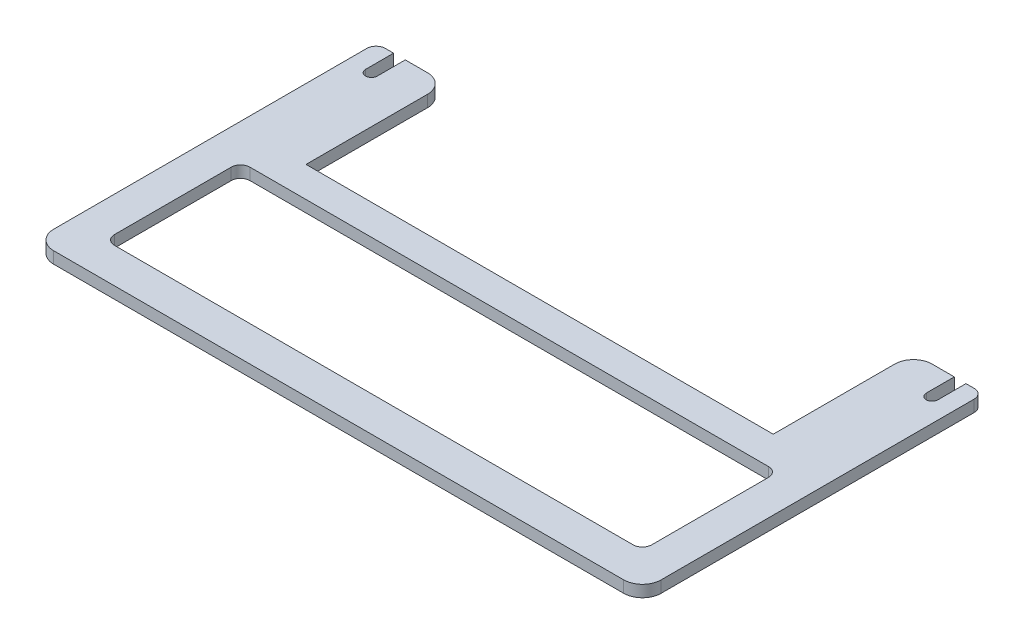
ISO-10303-21;
HEADER;
FILE_DESCRIPTION(('STEP AP214'),'2;1');
FILE_NAME('part.step','',(''),(''),'','','');
FILE_SCHEMA(('AUTOMOTIVE_DESIGN { 1 0 10303 214 1 1 1 1 }'));
ENDSEC;
DATA;
#1=APPLICATION_CONTEXT('core data for automotive mechanical design processes');
#2=APPLICATION_PROTOCOL_DEFINITION('international standard','automotive_design',2000,#1);
#3=PRODUCT_CONTEXT('',#1,'mechanical');
#4=PRODUCT('Part','Part','',(#3));
#5=PRODUCT_RELATED_PRODUCT_CATEGORY('part','',(#4));
#6=PRODUCT_DEFINITION_FORMATION('','',#4);
#7=PRODUCT_DEFINITION_CONTEXT('part definition',#1,'design');
#8=PRODUCT_DEFINITION('design','',#6,#7);
#9=PRODUCT_DEFINITION_SHAPE('','',#8);
#10=(LENGTH_UNIT() NAMED_UNIT(*) SI_UNIT(.MILLI.,.METRE.));
#11=(NAMED_UNIT(*) PLANE_ANGLE_UNIT() SI_UNIT($,.RADIAN.));
#12=(NAMED_UNIT(*) SI_UNIT($,.STERADIAN.) SOLID_ANGLE_UNIT());
#13=UNCERTAINTY_MEASURE_WITH_UNIT(LENGTH_MEASURE(1.E-05),#10,'distance_accuracy_value','');
#14=(GEOMETRIC_REPRESENTATION_CONTEXT(3) GLOBAL_UNCERTAINTY_ASSIGNED_CONTEXT((#13)) GLOBAL_UNIT_ASSIGNED_CONTEXT((#10,
#11,#12)) REPRESENTATION_CONTEXT('',''));
#15=CARTESIAN_POINT('',(0.,0.,0.));
#16=DIRECTION('',(0.,0.,1.));
#17=DIRECTION('',(1.,0.,0.));
#18=AXIS2_PLACEMENT_3D('',#15,#16,#17);
#19=CARTESIAN_POINT('',(152.4,-45.7905011983927,-92.71));
#20=DIRECTION('',(0.,0.,-1.));
#21=DIRECTION('',(-1.,0.,0.));
#22=AXIS2_PLACEMENT_3D('',#19,#20,#21);
#23=PLANE('',#22);
#24=DIRECTION('',(-1.,0.,0.));
#25=VECTOR('',#24,1.);
#26=CARTESIAN_POINT('',(152.4,0.,-92.71));
#27=LINE('',#26,#25);
#28=CARTESIAN_POINT('',(163.5125,0.,-92.71));
#29=VERTEX_POINT('',#28);
#30=CARTESIAN_POINT('',(157.48,0.,-92.71));
#31=VERTEX_POINT('',#30);
#32=EDGE_CURVE('E304',#29,#31,#27,.T.);
#33=ORIENTED_EDGE('',*,*,#32,.T.);
#34=DIRECTION('',(0.,1.,0.));
#35=VECTOR('',#34,1.);
#36=CARTESIAN_POINT('',(157.48,3.175,-92.71));
#37=LINE('',#36,#35);
#38=CARTESIAN_POINT('',(157.48,3.175,-92.71));
#39=VERTEX_POINT('',#38);
#40=EDGE_CURVE('E348',#31,#39,#37,.T.);
#41=ORIENTED_EDGE('',*,*,#40,.T.);
#42=DIRECTION('',(-1.,0.,0.));
#43=VECTOR('',#42,1.);
#44=CARTESIAN_POINT('',(152.4,3.175,-92.71));
#45=LINE('',#44,#43);
#46=CARTESIAN_POINT('',(163.5125,3.175,-92.71));
#47=VERTEX_POINT('',#46);
#48=EDGE_CURVE('E296',#47,#39,#45,.T.);
#49=ORIENTED_EDGE('',*,*,#48,.F.);
#50=DIRECTION('',(0.,1.,0.));
#51=VECTOR('',#50,1.);
#52=CARTESIAN_POINT('',(163.5125,0.,-92.71));
#53=LINE('',#52,#51);
#54=EDGE_CURVE('E272',#29,#47,#53,.T.);
#55=ORIENTED_EDGE('',*,*,#54,.F.);
#56=EDGE_LOOP('',(#33,#41,#49,#55));
#57=FACE_BOUND('',#56,.T.);
#58=ADVANCED_FACE('F33',(#57),#23,.T.);
#59=CARTESIAN_POINT('',(0.,-45.7905011983927,-92.71));
#60=DIRECTION('',(0.,0.,-1.));
#61=DIRECTION('',(-1.,0.,0.));
#62=AXIS2_PLACEMENT_3D('',#59,#60,#61);
#63=PLANE('',#62);
#64=DIRECTION('',(-1.,0.,0.));
#65=VECTOR('',#64,1.);
#66=CARTESIAN_POINT('',(0.,3.175,-92.71));
#67=LINE('',#66,#65);
#68=CARTESIAN_POINT('',(20.32,3.175,-92.71));
#69=VERTEX_POINT('',#68);
#70=CARTESIAN_POINT('',(14.2875,3.175,-92.71));
#71=VERTEX_POINT('',#70);
#72=EDGE_CURVE('E308',#69,#71,#67,.T.);
#73=ORIENTED_EDGE('',*,*,#72,.F.);
#74=DIRECTION('',(0.,1.,0.));
#75=VECTOR('',#74,1.);
#76=CARTESIAN_POINT('',(20.32,0.,-92.71));
#77=LINE('',#76,#75);
#78=CARTESIAN_POINT('',(20.32,0.,-92.71));
#79=VERTEX_POINT('',#78);
#80=EDGE_CURVE('E356',#69,#79,#77,.F.);
#81=ORIENTED_EDGE('',*,*,#80,.T.);
#82=DIRECTION('',(-1.,0.,0.));
#83=VECTOR('',#82,1.);
#84=CARTESIAN_POINT('',(0.,0.,-92.71));
#85=LINE('',#84,#83);
#86=CARTESIAN_POINT('',(14.2875,0.,-92.71));
#87=VERTEX_POINT('',#86);
#88=EDGE_CURVE('E311',#79,#87,#85,.T.);
#89=ORIENTED_EDGE('',*,*,#88,.T.);
#90=DIRECTION('',(0.,1.,0.));
#91=VECTOR('',#90,1.);
#92=CARTESIAN_POINT('',(14.2875,0.,-92.71));
#93=LINE('',#92,#91);
#94=EDGE_CURVE('E293',#87,#71,#93,.T.);
#95=ORIENTED_EDGE('',*,*,#94,.T.);
#96=EDGE_LOOP('',(#73,#81,#89,#95));
#97=FACE_BOUND('',#96,.T.);
#98=ADVANCED_FACE('F499',(#97),#63,.T.);
#99=CARTESIAN_POINT('',(0.,3.175,0.));
#100=DIRECTION('',(0.,0.,-1.));
#101=DIRECTION('',(-1.,0.,0.));
#102=AXIS2_PLACEMENT_3D('',#99,#100,#101);
#103=PLANE('',#102);
#104=DIRECTION('',(1.,0.,0.));
#105=VECTOR('',#104,1.);
#106=CARTESIAN_POINT('',(0.,0.,0.));
#107=LINE('',#106,#105);
#108=CARTESIAN_POINT('',(11.43,0.,0.));
#109=VERTEX_POINT('',#108);
#110=CARTESIAN_POINT('',(166.37,0.,0.));
#111=VERTEX_POINT('',#110);
#112=EDGE_CURVE('E332',#109,#111,#107,.T.);
#113=ORIENTED_EDGE('',*,*,#112,.T.);
#114=DIRECTION('',(0.,1.,0.));
#115=VECTOR('',#114,1.);
#116=CARTESIAN_POINT('',(166.37,3.175,0.));
#117=LINE('',#116,#115);
#118=CARTESIAN_POINT('',(166.37,3.175,0.));
#119=VERTEX_POINT('',#118);
#120=EDGE_CURVE('E380',#111,#119,#117,.T.);
#121=ORIENTED_EDGE('',*,*,#120,.T.);
#122=DIRECTION('',(1.,0.,0.));
#123=VECTOR('',#122,1.);
#124=CARTESIAN_POINT('',(0.,3.175,0.));
#125=LINE('',#124,#123);
#126=CARTESIAN_POINT('',(11.43,3.175,0.));
#127=VERTEX_POINT('',#126);
#128=EDGE_CURVE('E335',#127,#119,#125,.T.);
#129=ORIENTED_EDGE('',*,*,#128,.F.);
#130=DIRECTION('',(0.,1.,0.));
#131=VECTOR('',#130,1.);
#132=CARTESIAN_POINT('',(11.43,3.175,0.));
#133=LINE('',#132,#131);
#134=EDGE_CURVE('E378',#127,#109,#133,.F.);
#135=ORIENTED_EDGE('',*,*,#134,.T.);
#136=EDGE_LOOP('',(#113,#121,#129,#135));
#137=FACE_BOUND('',#136,.T.);
#138=ADVANCED_FACE('F549',(#137),#103,.F.);
#139=CARTESIAN_POINT('',(0.,3.175,0.));
#140=DIRECTION('',(0.,-1.,0.));
#141=DIRECTION('',(0.,0.,-1.));
#142=AXIS2_PLACEMENT_3D('',#139,#140,#141);
#143=PLANE('',#142);
#144=DIRECTION('',(1.,0.,0.));
#145=VECTOR('',#144,1.);
#146=CARTESIAN_POINT('',(15.875,3.175,-9.525));
#147=LINE('',#146,#145);
#148=CARTESIAN_POINT('',(18.415,3.175,-9.525));
#149=VERTEX_POINT('',#148);
#150=CARTESIAN_POINT('',(159.385,3.175,-9.525));
#151=VERTEX_POINT('',#150);
#152=EDGE_CURVE('E432',#149,#151,#147,.T.);
#153=ORIENTED_EDGE('',*,*,#152,.F.);
#154=CARTESIAN_POINT('',(18.415,3.175,-12.065));
#155=DIRECTION('',(0.,-1.,0.));
#156=DIRECTION('',(0.,0.,-1.));
#157=AXIS2_PLACEMENT_3D('',#154,#155,#156);
#158=CIRCLE('',#157,2.54);
#159=CARTESIAN_POINT('',(15.875,3.175,-12.065));
#160=VERTEX_POINT('',#159);
#161=EDGE_CURVE('E41',#149,#160,#158,.T.);
#162=ORIENTED_EDGE('',*,*,#161,.T.);
#163=DIRECTION('',(0.,0.,1.));
#164=VECTOR('',#163,1.);
#165=CARTESIAN_POINT('',(15.875,3.175,-46.355));
#166=LINE('',#165,#164);
#167=CARTESIAN_POINT('',(15.875,3.175,-43.8149999999999));
#168=VERTEX_POINT('',#167);
#169=EDGE_CURVE('E430',#168,#160,#166,.T.);
#170=ORIENTED_EDGE('',*,*,#169,.F.);
#171=CARTESIAN_POINT('',(18.415,3.175,-43.8149999999999));
#172=DIRECTION('',(0.,-1.,0.));
#173=DIRECTION('',(0.,0.,-1.));
#174=AXIS2_PLACEMENT_3D('',#171,#172,#173);
#175=CIRCLE('',#174,2.54);
#176=CARTESIAN_POINT('',(18.415,3.175,-46.355));
#177=VERTEX_POINT('',#176);
#178=EDGE_CURVE('E423',#168,#177,#175,.T.);
#179=ORIENTED_EDGE('',*,*,#178,.T.);
#180=DIRECTION('',(-1.,0.,0.));
#181=VECTOR('',#180,1.);
#182=CARTESIAN_POINT('',(15.875,3.175,-46.355));
#183=LINE('',#182,#181);
#184=CARTESIAN_POINT('',(159.385,3.175,-46.355));
#185=VERTEX_POINT('',#184);
#186=EDGE_CURVE('E452',#185,#177,#183,.T.);
#187=ORIENTED_EDGE('',*,*,#186,.F.);
#188=CARTESIAN_POINT('',(159.385,3.175,-43.8149999999999));
#189=DIRECTION('',(0.,-1.,0.));
#190=DIRECTION('',(0.,0.,-1.));
#191=AXIS2_PLACEMENT_3D('',#188,#189,#190);
#192=CIRCLE('',#191,2.54);
#193=CARTESIAN_POINT('',(161.925,3.175,-43.8149999999999));
#194=VERTEX_POINT('',#193);
#195=EDGE_CURVE('E415',#185,#194,#192,.T.);
#196=ORIENTED_EDGE('',*,*,#195,.T.);
#197=DIRECTION('',(0.,0.,-1.));
#198=VECTOR('',#197,1.);
#199=CARTESIAN_POINT('',(161.925,3.175,-46.355));
#200=LINE('',#199,#198);
#201=CARTESIAN_POINT('',(161.925,3.175,-12.065));
#202=VERTEX_POINT('',#201);
#203=EDGE_CURVE('E458',#202,#194,#200,.T.);
#204=ORIENTED_EDGE('',*,*,#203,.F.);
#205=CARTESIAN_POINT('',(159.385,3.175,-12.065));
#206=DIRECTION('',(0.,-1.,0.));
#207=DIRECTION('',(0.,0.,-1.));
#208=AXIS2_PLACEMENT_3D('',#205,#206,#207);
#209=CIRCLE('',#208,2.54);
#210=EDGE_CURVE('E419',#202,#151,#209,.T.);
#211=ORIENTED_EDGE('',*,*,#210,.T.);
#212=EDGE_LOOP('',(#153,#162,#170,#179,#187,#196,#204,#211));
#213=FACE_BOUND('',#212,.T.);
#214=ORIENTED_EDGE('',*,*,#128,.T.);
#215=CARTESIAN_POINT('',(166.37,3.175,-5.08));
#216=DIRECTION('',(0.,-1.,0.));
#217=DIRECTION('',(0.,0.,-1.));
#218=AXIS2_PLACEMENT_3D('',#215,#216,#217);
#219=CIRCLE('',#218,5.08);
#220=CARTESIAN_POINT('',(171.45,3.175,-5.08));
#221=VERTEX_POINT('',#220);
#222=EDGE_CURVE('E385',#119,#221,#219,.F.);
#223=ORIENTED_EDGE('',*,*,#222,.T.);
#224=DIRECTION('',(0.,0.,1.));
#225=VECTOR('',#224,1.);
#226=CARTESIAN_POINT('',(171.45,3.175,0.));
#227=LINE('',#226,#225);
#228=CARTESIAN_POINT('',(171.45,3.175,-90.17));
#229=VERTEX_POINT('',#228);
#230=EDGE_CURVE('E455',#229,#221,#227,.T.);
#231=ORIENTED_EDGE('',*,*,#230,.F.);
#232=CARTESIAN_POINT('',(168.91,3.175,-90.17));
#233=DIRECTION('',(0.,-1.,0.));
#234=DIRECTION('',(0.,0.,-1.));
#235=AXIS2_PLACEMENT_3D('',#232,#233,#234);
#236=CIRCLE('',#235,2.54);
#237=CARTESIAN_POINT('',(168.91,3.175,-92.71));
#238=VERTEX_POINT('',#237);
#239=EDGE_CURVE('E364',#229,#238,#236,.F.);
#240=ORIENTED_EDGE('',*,*,#239,.T.);
#241=CARTESIAN_POINT('',(166.6875,3.175,-92.71));
#242=VERTEX_POINT('',#241);
#243=EDGE_CURVE('E302',#238,#242,#45,.T.);
#244=ORIENTED_EDGE('',*,*,#243,.T.);
#245=DIRECTION('',(0.,0.,-1.));
#246=VECTOR('',#245,1.);
#247=CARTESIAN_POINT('',(166.6875,3.175,-92.71));
#248=LINE('',#247,#246);
#249=CARTESIAN_POINT('',(166.6875,3.175,-85.09));
#250=VERTEX_POINT('',#249);
#251=EDGE_CURVE('E259',#250,#242,#248,.T.);
#252=ORIENTED_EDGE('',*,*,#251,.F.);
#253=CARTESIAN_POINT('',(165.1,3.175,-85.09));
#254=DIRECTION('',(0.,1.,0.));
#255=DIRECTION('',(0.,0.,-1.));
#256=AXIS2_PLACEMENT_3D('',#253,#254,#255);
#257=CIRCLE('',#256,1.58749999999999);
#258=CARTESIAN_POINT('',(163.5125,3.175,-85.09));
#259=VERTEX_POINT('',#258);
#260=EDGE_CURVE('E238',#259,#250,#257,.T.);
#261=ORIENTED_EDGE('',*,*,#260,.F.);
#262=DIRECTION('',(0.,0.,1.));
#263=VECTOR('',#262,1.);
#264=CARTESIAN_POINT('',(163.5125,3.175,-85.09));
#265=LINE('',#264,#263);
#266=EDGE_CURVE('E256',#47,#259,#265,.T.);
#267=ORIENTED_EDGE('',*,*,#266,.F.);
#268=ORIENTED_EDGE('',*,*,#48,.T.);
#269=CARTESIAN_POINT('',(157.48,3.175,-87.63));
#270=DIRECTION('',(0.,-1.,0.));
#271=DIRECTION('',(0.,0.,-1.));
#272=AXIS2_PLACEMENT_3D('',#269,#270,#271);
#273=CIRCLE('',#272,5.08);
#274=CARTESIAN_POINT('',(152.4,3.175,-87.63));
#275=VERTEX_POINT('',#274);
#276=EDGE_CURVE('E342',#39,#275,#273,.F.);
#277=ORIENTED_EDGE('',*,*,#276,.T.);
#278=DIRECTION('',(0.,0.,-1.));
#279=VECTOR('',#278,1.);
#280=CARTESIAN_POINT('',(152.4,3.175,-54.6099999999999));
#281=LINE('',#280,#279);
#282=CARTESIAN_POINT('',(152.4,3.175,-54.6099999999999));
#283=VERTEX_POINT('',#282);
#284=EDGE_CURVE('E317',#283,#275,#281,.T.);
#285=ORIENTED_EDGE('',*,*,#284,.F.);
#286=DIRECTION('',(1.,0.,0.));
#287=VECTOR('',#286,1.);
#288=CARTESIAN_POINT('',(25.4,3.175,-54.6099999999999));
#289=LINE('',#288,#287);
#290=CARTESIAN_POINT('',(25.4,3.175,-54.6099999999999));
#291=VERTEX_POINT('',#290);
#292=EDGE_CURVE('E325',#291,#283,#289,.T.);
#293=ORIENTED_EDGE('',*,*,#292,.F.);
#294=DIRECTION('',(0.,0.,1.));
#295=VECTOR('',#294,1.);
#296=CARTESIAN_POINT('',(25.4,3.175,-67.31));
#297=LINE('',#296,#295);
#298=CARTESIAN_POINT('',(25.4,3.175,-87.63));
#299=VERTEX_POINT('',#298);
#300=EDGE_CURVE('E313',#299,#291,#297,.T.);
#301=ORIENTED_EDGE('',*,*,#300,.F.);
#302=CARTESIAN_POINT('',(20.32,3.175,-87.63));
#303=DIRECTION('',(0.,-1.,0.));
#304=DIRECTION('',(0.,0.,-1.));
#305=AXIS2_PLACEMENT_3D('',#302,#303,#304);
#306=CIRCLE('',#305,5.08);
#307=EDGE_CURVE('E338',#299,#69,#306,.F.);
#308=ORIENTED_EDGE('',*,*,#307,.T.);
#309=ORIENTED_EDGE('',*,*,#72,.T.);
#310=DIRECTION('',(0.,0.,-1.));
#311=VECTOR('',#310,1.);
#312=CARTESIAN_POINT('',(14.2875,3.175,-85.09));
#313=LINE('',#312,#311);
#314=CARTESIAN_POINT('',(14.2875,3.175,-85.09));
#315=VERTEX_POINT('',#314);
#316=EDGE_CURVE('E279',#315,#71,#313,.T.);
#317=ORIENTED_EDGE('',*,*,#316,.F.);
#318=CARTESIAN_POINT('',(12.7,3.175,-85.09));
#319=DIRECTION('',(0.,1.,0.));
#320=DIRECTION('',(0.,0.,1.));
#321=AXIS2_PLACEMENT_3D('',#318,#319,#320);
#322=CIRCLE('',#321,1.5875);
#323=CARTESIAN_POINT('',(11.1125,3.175,-85.09));
#324=VERTEX_POINT('',#323);
#325=EDGE_CURVE('E288',#324,#315,#322,.T.);
#326=ORIENTED_EDGE('',*,*,#325,.F.);
#327=DIRECTION('',(0.,0.,1.));
#328=VECTOR('',#327,1.);
#329=CARTESIAN_POINT('',(11.1125,3.175,-92.71));
#330=LINE('',#329,#328);
#331=CARTESIAN_POINT('',(11.1125,3.175,-92.71));
#332=VERTEX_POINT('',#331);
#333=EDGE_CURVE('E271',#332,#324,#330,.T.);
#334=ORIENTED_EDGE('',*,*,#333,.F.);
#335=CARTESIAN_POINT('',(8.89,3.175,-92.71));
#336=VERTEX_POINT('',#335);
#337=EDGE_CURVE('E307',#332,#336,#67,.T.);
#338=ORIENTED_EDGE('',*,*,#337,.T.);
#339=CARTESIAN_POINT('',(8.89,3.175,-90.17));
#340=DIRECTION('',(0.,-1.,0.));
#341=DIRECTION('',(0.,0.,-1.));
#342=AXIS2_PLACEMENT_3D('',#339,#340,#341);
#343=CIRCLE('',#342,2.54);
#344=CARTESIAN_POINT('',(6.35,3.175,-90.17));
#345=VERTEX_POINT('',#344);
#346=EDGE_CURVE('E361',#336,#345,#343,.F.);
#347=ORIENTED_EDGE('',*,*,#346,.T.);
#348=DIRECTION('',(0.,0.,-1.));
#349=VECTOR('',#348,1.);
#350=CARTESIAN_POINT('',(6.35,3.175,0.));
#351=LINE('',#350,#349);
#352=CARTESIAN_POINT('',(6.35,3.175,-5.08));
#353=VERTEX_POINT('',#352);
#354=EDGE_CURVE('E262',#353,#345,#351,.T.);
#355=ORIENTED_EDGE('',*,*,#354,.F.);
#356=CARTESIAN_POINT('',(11.43,3.175,-5.08));
#357=DIRECTION('',(0.,-1.,0.));
#358=DIRECTION('',(0.,0.,-1.));
#359=AXIS2_PLACEMENT_3D('',#356,#357,#358);
#360=CIRCLE('',#359,5.08);
#361=EDGE_CURVE('E383',#353,#127,#360,.F.);
#362=ORIENTED_EDGE('',*,*,#361,.T.);
#363=EDGE_LOOP('',(#214,#223,#231,#240,#244,#252,#261,#267,#268,#277,#285,#293,#301,#308,#309,
#317,#326,#334,#338,#347,#355,#362));
#364=FACE_BOUND('',#363,.T.);
#365=ADVANCED_FACE('F428',(#213,#364),#143,.F.);
#366=CARTESIAN_POINT('',(0.,0.,0.));
#367=DIRECTION('',(0.,-1.,0.));
#368=DIRECTION('',(0.,0.,-1.));
#369=AXIS2_PLACEMENT_3D('',#366,#367,#368);
#370=PLANE('',#369);
#371=DIRECTION('',(-1.,0.,0.));
#372=VECTOR('',#371,1.);
#373=CARTESIAN_POINT('',(15.875,0.,-46.355));
#374=LINE('',#373,#372);
#375=CARTESIAN_POINT('',(159.385,0.,-46.355));
#376=VERTEX_POINT('',#375);
#377=CARTESIAN_POINT('',(18.415,0.,-46.355));
#378=VERTEX_POINT('',#377);
#379=EDGE_CURVE('E450',#376,#378,#374,.T.);
#380=ORIENTED_EDGE('',*,*,#379,.T.);
#381=CARTESIAN_POINT('',(18.415,0.,-43.8149999999999));
#382=DIRECTION('',(0.,-1.,0.));
#383=DIRECTION('',(0.,0.,-1.));
#384=AXIS2_PLACEMENT_3D('',#381,#382,#383);
#385=CIRCLE('',#384,2.54);
#386=CARTESIAN_POINT('',(15.875,0.,-43.8149999999999));
#387=VERTEX_POINT('',#386);
#388=EDGE_CURVE('E55',#378,#387,#385,.F.);
#389=ORIENTED_EDGE('',*,*,#388,.T.);
#390=DIRECTION('',(0.,0.,1.));
#391=VECTOR('',#390,1.);
#392=CARTESIAN_POINT('',(15.875,0.,-46.355));
#393=LINE('',#392,#391);
#394=CARTESIAN_POINT('',(15.875,0.,-12.065));
#395=VERTEX_POINT('',#394);
#396=EDGE_CURVE('E443',#387,#395,#393,.T.);
#397=ORIENTED_EDGE('',*,*,#396,.T.);
#398=CARTESIAN_POINT('',(18.415,0.,-12.065));
#399=DIRECTION('',(0.,-1.,0.));
#400=DIRECTION('',(0.,0.,-1.));
#401=AXIS2_PLACEMENT_3D('',#398,#399,#400);
#402=CIRCLE('',#401,2.54);
#403=CARTESIAN_POINT('',(18.415,0.,-9.525));
#404=VERTEX_POINT('',#403);
#405=EDGE_CURVE('E11',#395,#404,#402,.F.);
#406=ORIENTED_EDGE('',*,*,#405,.T.);
#407=DIRECTION('',(1.,0.,0.));
#408=VECTOR('',#407,1.);
#409=CARTESIAN_POINT('',(15.875,0.,-9.525));
#410=LINE('',#409,#408);
#411=CARTESIAN_POINT('',(159.385,0.,-9.525));
#412=VERTEX_POINT('',#411);
#413=EDGE_CURVE('E441',#404,#412,#410,.T.);
#414=ORIENTED_EDGE('',*,*,#413,.T.);
#415=CARTESIAN_POINT('',(159.385,0.,-12.065));
#416=DIRECTION('',(0.,-1.,0.));
#417=DIRECTION('',(0.,0.,-1.));
#418=AXIS2_PLACEMENT_3D('',#415,#416,#417);
#419=CIRCLE('',#418,2.54);
#420=CARTESIAN_POINT('',(161.925,0.,-12.065));
#421=VERTEX_POINT('',#420);
#422=EDGE_CURVE('E421',#412,#421,#419,.F.);
#423=ORIENTED_EDGE('',*,*,#422,.T.);
#424=DIRECTION('',(0.,0.,-1.));
#425=VECTOR('',#424,1.);
#426=CARTESIAN_POINT('',(161.925,0.,-46.355));
#427=LINE('',#426,#425);
#428=CARTESIAN_POINT('',(161.925,0.,-43.8149999999999));
#429=VERTEX_POINT('',#428);
#430=EDGE_CURVE('E447',#421,#429,#427,.T.);
#431=ORIENTED_EDGE('',*,*,#430,.T.);
#432=CARTESIAN_POINT('',(159.385,0.,-43.8149999999999));
#433=DIRECTION('',(0.,-1.,0.));
#434=DIRECTION('',(0.,0.,-1.));
#435=AXIS2_PLACEMENT_3D('',#432,#433,#434);
#436=CIRCLE('',#435,2.54);
#437=EDGE_CURVE('E417',#429,#376,#436,.F.);
#438=ORIENTED_EDGE('',*,*,#437,.T.);
#439=EDGE_LOOP('',(#380,#389,#397,#406,#414,#423,#431,#438));
#440=FACE_BOUND('',#439,.T.);
#441=DIRECTION('',(0.,0.,1.));
#442=VECTOR('',#441,1.);
#443=CARTESIAN_POINT('',(171.45,0.,0.));
#444=LINE('',#443,#442);
#445=CARTESIAN_POINT('',(171.45,0.,-90.17));
#446=VERTEX_POINT('',#445);
#447=CARTESIAN_POINT('',(171.45,0.,-5.08));
#448=VERTEX_POINT('',#447);
#449=EDGE_CURVE('E463',#446,#448,#444,.T.);
#450=ORIENTED_EDGE('',*,*,#449,.T.);
#451=CARTESIAN_POINT('',(166.37,0.,-5.08));
#452=DIRECTION('',(0.,-1.,0.));
#453=DIRECTION('',(0.,0.,-1.));
#454=AXIS2_PLACEMENT_3D('',#451,#452,#453);
#455=CIRCLE('',#454,5.08);
#456=EDGE_CURVE('E391',#448,#111,#455,.T.);
#457=ORIENTED_EDGE('',*,*,#456,.T.);
#458=ORIENTED_EDGE('',*,*,#112,.F.);
#459=CARTESIAN_POINT('',(11.43,0.,-5.08));
#460=DIRECTION('',(0.,-1.,0.));
#461=DIRECTION('',(0.,0.,-1.));
#462=AXIS2_PLACEMENT_3D('',#459,#460,#461);
#463=CIRCLE('',#462,5.08);
#464=CARTESIAN_POINT('',(6.35,0.,-5.08));
#465=VERTEX_POINT('',#464);
#466=EDGE_CURVE('E389',#109,#465,#463,.T.);
#467=ORIENTED_EDGE('',*,*,#466,.T.);
#468=DIRECTION('',(0.,0.,-1.));
#469=VECTOR('',#468,1.);
#470=CARTESIAN_POINT('',(6.35,0.,0.));
#471=LINE('',#470,#469);
#472=CARTESIAN_POINT('',(6.35,0.,-90.17));
#473=VERTEX_POINT('',#472);
#474=EDGE_CURVE('E267',#465,#473,#471,.T.);
#475=ORIENTED_EDGE('',*,*,#474,.T.);
#476=CARTESIAN_POINT('',(8.89,0.,-90.17));
#477=DIRECTION('',(0.,-1.,0.));
#478=DIRECTION('',(0.,0.,-1.));
#479=AXIS2_PLACEMENT_3D('',#476,#477,#478);
#480=CIRCLE('',#479,2.54);
#481=CARTESIAN_POINT('',(8.89,0.,-92.71));
#482=VERTEX_POINT('',#481);
#483=EDGE_CURVE('E368',#473,#482,#480,.T.);
#484=ORIENTED_EDGE('',*,*,#483,.T.);
#485=CARTESIAN_POINT('',(11.1125,0.,-92.71));
#486=VERTEX_POINT('',#485);
#487=EDGE_CURVE('E310',#486,#482,#85,.T.);
#488=ORIENTED_EDGE('',*,*,#487,.F.);
#489=DIRECTION('',(0.,0.,1.));
#490=VECTOR('',#489,1.);
#491=CARTESIAN_POINT('',(11.1125,0.,-92.71));
#492=LINE('',#491,#490);
#493=CARTESIAN_POINT('',(11.1125,0.,-85.09));
#494=VERTEX_POINT('',#493);
#495=EDGE_CURVE('E275',#486,#494,#492,.T.);
#496=ORIENTED_EDGE('',*,*,#495,.T.);
#497=CARTESIAN_POINT('',(12.7,0.,-85.09));
#498=DIRECTION('',(0.,1.,0.));
#499=DIRECTION('',(0.,0.,1.));
#500=AXIS2_PLACEMENT_3D('',#497,#498,#499);
#501=CIRCLE('',#500,1.5875);
#502=CARTESIAN_POINT('',(14.2875,0.,-85.09));
#503=VERTEX_POINT('',#502);
#504=EDGE_CURVE('E278',#494,#503,#501,.T.);
#505=ORIENTED_EDGE('',*,*,#504,.T.);
#506=DIRECTION('',(0.,0.,-1.));
#507=VECTOR('',#506,1.);
#508=CARTESIAN_POINT('',(14.2875,0.,-85.09));
#509=LINE('',#508,#507);
#510=EDGE_CURVE('E282',#503,#87,#509,.T.);
#511=ORIENTED_EDGE('',*,*,#510,.T.);
#512=ORIENTED_EDGE('',*,*,#88,.F.);
#513=CARTESIAN_POINT('',(20.32,0.,-87.63));
#514=DIRECTION('',(0.,-1.,0.));
#515=DIRECTION('',(0.,0.,-1.));
#516=AXIS2_PLACEMENT_3D('',#513,#514,#515);
#517=CIRCLE('',#516,5.08);
#518=CARTESIAN_POINT('',(25.4,0.,-87.63));
#519=VERTEX_POINT('',#518);
#520=EDGE_CURVE('E344',#79,#519,#517,.T.);
#521=ORIENTED_EDGE('',*,*,#520,.T.);
#522=DIRECTION('',(0.,0.,1.));
#523=VECTOR('',#522,1.);
#524=CARTESIAN_POINT('',(25.4,0.,-67.31));
#525=LINE('',#524,#523);
#526=CARTESIAN_POINT('',(25.4,0.,-54.6099999999999));
#527=VERTEX_POINT('',#526);
#528=EDGE_CURVE('E314',#519,#527,#525,.T.);
#529=ORIENTED_EDGE('',*,*,#528,.T.);
#530=DIRECTION('',(1.,0.,0.));
#531=VECTOR('',#530,1.);
#532=CARTESIAN_POINT('',(25.4,0.,-54.6099999999999));
#533=LINE('',#532,#531);
#534=CARTESIAN_POINT('',(152.4,0.,-54.6099999999999));
#535=VERTEX_POINT('',#534);
#536=EDGE_CURVE('E316',#527,#535,#533,.T.);
#537=ORIENTED_EDGE('',*,*,#536,.T.);
#538=DIRECTION('',(0.,0.,-1.));
#539=VECTOR('',#538,1.);
#540=CARTESIAN_POINT('',(152.4,0.,-54.6099999999999));
#541=LINE('',#540,#539);
#542=CARTESIAN_POINT('',(152.4,0.,-87.63));
#543=VERTEX_POINT('',#542);
#544=EDGE_CURVE('E320',#535,#543,#541,.T.);
#545=ORIENTED_EDGE('',*,*,#544,.T.);
#546=CARTESIAN_POINT('',(157.48,0.,-87.63));
#547=DIRECTION('',(0.,-1.,0.));
#548=DIRECTION('',(0.,0.,-1.));
#549=AXIS2_PLACEMENT_3D('',#546,#547,#548);
#550=CIRCLE('',#549,5.08);
#551=EDGE_CURVE('E346',#543,#31,#550,.T.);
#552=ORIENTED_EDGE('',*,*,#551,.T.);
#553=ORIENTED_EDGE('',*,*,#32,.F.);
#554=DIRECTION('',(0.,0.,1.));
#555=VECTOR('',#554,1.);
#556=CARTESIAN_POINT('',(163.5125,0.,-85.09));
#557=LINE('',#556,#555);
#558=CARTESIAN_POINT('',(163.5125,0.,-85.09));
#559=VERTEX_POINT('',#558);
#560=EDGE_CURVE('E243',#29,#559,#557,.T.);
#561=ORIENTED_EDGE('',*,*,#560,.T.);
#562=CARTESIAN_POINT('',(165.1,0.,-85.09));
#563=DIRECTION('',(0.,1.,0.));
#564=DIRECTION('',(0.,0.,-1.));
#565=AXIS2_PLACEMENT_3D('',#562,#563,#564);
#566=CIRCLE('',#565,1.58749999999999);
#567=CARTESIAN_POINT('',(166.6875,0.,-85.09));
#568=VERTEX_POINT('',#567);
#569=EDGE_CURVE('E235',#559,#568,#566,.T.);
#570=ORIENTED_EDGE('',*,*,#569,.T.);
#571=DIRECTION('',(0.,0.,-1.));
#572=VECTOR('',#571,1.);
#573=CARTESIAN_POINT('',(166.6875,0.,-92.71));
#574=LINE('',#573,#572);
#575=CARTESIAN_POINT('',(166.6875,0.,-92.71));
#576=VERTEX_POINT('',#575);
#577=EDGE_CURVE('E247',#568,#576,#574,.T.);
#578=ORIENTED_EDGE('',*,*,#577,.T.);
#579=CARTESIAN_POINT('',(168.91,0.,-92.71));
#580=VERTEX_POINT('',#579);
#581=EDGE_CURVE('E305',#580,#576,#27,.T.);
#582=ORIENTED_EDGE('',*,*,#581,.F.);
#583=CARTESIAN_POINT('',(168.91,0.,-90.17));
#584=DIRECTION('',(0.,-1.,0.));
#585=DIRECTION('',(0.,0.,-1.));
#586=AXIS2_PLACEMENT_3D('',#583,#584,#585);
#587=CIRCLE('',#586,2.54);
#588=EDGE_CURVE('E370',#580,#446,#587,.T.);
#589=ORIENTED_EDGE('',*,*,#588,.T.);
#590=EDGE_LOOP('',(#450,#457,#458,#467,#475,#484,#488,#496,#505,#511,#512,#521,#529,#537,#545,
#552,#553,#561,#570,#578,#582,#589));
#591=FACE_BOUND('',#590,.T.);
#592=ADVANCED_FACE('F254',(#440,#591),#370,.T.);
#593=CARTESIAN_POINT('',(152.4,0.,-54.6099999999999));
#594=DIRECTION('',(1.,0.,0.));
#595=DIRECTION('',(0.,0.,-1.));
#596=AXIS2_PLACEMENT_3D('',#593,#594,#595);
#597=PLANE('',#596);
#598=ORIENTED_EDGE('',*,*,#284,.T.);
#599=DIRECTION('',(0.,1.,0.));
#600=VECTOR('',#599,1.);
#601=CARTESIAN_POINT('',(152.4,0.,-87.63));
#602=LINE('',#601,#600);
#603=EDGE_CURVE('E351',#275,#543,#602,.F.);
#604=ORIENTED_EDGE('',*,*,#603,.T.);
#605=ORIENTED_EDGE('',*,*,#544,.F.);
#606=DIRECTION('',(0.,1.,0.));
#607=VECTOR('',#606,1.);
#608=CARTESIAN_POINT('',(152.4,0.,-54.6099999999999));
#609=LINE('',#608,#607);
#610=EDGE_CURVE('E330',#535,#283,#609,.T.);
#611=ORIENTED_EDGE('',*,*,#610,.T.);
#612=EDGE_LOOP('',(#598,#604,#605,#611));
#613=FACE_BOUND('',#612,.T.);
#614=ADVANCED_FACE('F517',(#613),#597,.F.);
#615=CARTESIAN_POINT('',(25.4,0.,-54.6099999999999));
#616=DIRECTION('',(0.,0.,1.));
#617=DIRECTION('',(1.,0.,0.));
#618=AXIS2_PLACEMENT_3D('',#615,#616,#617);
#619=PLANE('',#618);
#620=ORIENTED_EDGE('',*,*,#292,.T.);
#621=ORIENTED_EDGE('',*,*,#610,.F.);
#622=ORIENTED_EDGE('',*,*,#536,.F.);
#623=DIRECTION('',(0.,1.,0.));
#624=VECTOR('',#623,1.);
#625=CARTESIAN_POINT('',(25.4,0.,-54.6099999999999));
#626=LINE('',#625,#624);
#627=EDGE_CURVE('E323',#527,#291,#626,.T.);
#628=ORIENTED_EDGE('',*,*,#627,.T.);
#629=EDGE_LOOP('',(#620,#621,#622,#628));
#630=FACE_BOUND('',#629,.T.);
#631=ADVANCED_FACE('F512',(#630),#619,.F.);
#632=CARTESIAN_POINT('',(25.4,0.,-67.31));
#633=DIRECTION('',(-1.,0.,0.));
#634=DIRECTION('',(0.,0.,1.));
#635=AXIS2_PLACEMENT_3D('',#632,#633,#634);
#636=PLANE('',#635);
#637=ORIENTED_EDGE('',*,*,#528,.F.);
#638=DIRECTION('',(0.,1.,0.));
#639=VECTOR('',#638,1.);
#640=CARTESIAN_POINT('',(25.4,3.175,-87.63));
#641=LINE('',#640,#639);
#642=EDGE_CURVE('E353',#519,#299,#641,.T.);
#643=ORIENTED_EDGE('',*,*,#642,.T.);
#644=ORIENTED_EDGE('',*,*,#300,.T.);
#645=ORIENTED_EDGE('',*,*,#627,.F.);
#646=EDGE_LOOP('',(#637,#643,#644,#645));
#647=FACE_BOUND('',#646,.T.);
#648=ADVANCED_FACE('F508',(#647),#636,.F.);
#649=ORIENTED_EDGE('',*,*,#487,.T.);
#650=DIRECTION('',(0.,1.,0.));
#651=VECTOR('',#650,1.);
#652=CARTESIAN_POINT('',(8.89,3.175,-92.71));
#653=LINE('',#652,#651);
#654=EDGE_CURVE('E372',#482,#336,#653,.T.);
#655=ORIENTED_EDGE('',*,*,#654,.T.);
#656=ORIENTED_EDGE('',*,*,#337,.F.);
#657=DIRECTION('',(0.,1.,0.));
#658=VECTOR('',#657,1.);
#659=CARTESIAN_POINT('',(11.1125,0.,-92.71));
#660=LINE('',#659,#658);
#661=EDGE_CURVE('E285',#486,#332,#660,.T.);
#662=ORIENTED_EDGE('',*,*,#661,.F.);
#663=EDGE_LOOP('',(#649,#655,#656,#662));
#664=FACE_BOUND('',#663,.T.);
#665=ADVANCED_FACE('F483',(#664),#63,.T.);
#666=ORIENTED_EDGE('',*,*,#243,.F.);
#667=DIRECTION('',(0.,1.,0.));
#668=VECTOR('',#667,1.);
#669=CARTESIAN_POINT('',(168.91,0.,-92.71));
#670=LINE('',#669,#668);
#671=EDGE_CURVE('E366',#238,#580,#670,.F.);
#672=ORIENTED_EDGE('',*,*,#671,.T.);
#673=ORIENTED_EDGE('',*,*,#581,.T.);
#674=DIRECTION('',(0.,1.,0.));
#675=VECTOR('',#674,1.);
#676=CARTESIAN_POINT('',(166.6875,0.,-92.71));
#677=LINE('',#676,#675);
#678=EDGE_CURVE('E242',#576,#242,#677,.T.);
#679=ORIENTED_EDGE('',*,*,#678,.T.);
#680=EDGE_LOOP('',(#666,#672,#673,#679));
#681=FACE_BOUND('',#680,.T.);
#682=ADVANCED_FACE('F532',(#681),#23,.T.);
#683=CARTESIAN_POINT('',(14.2875,0.,-85.09));
#684=DIRECTION('',(1.,0.,0.));
#685=DIRECTION('',(0.,0.,-1.));
#686=AXIS2_PLACEMENT_3D('',#683,#684,#685);
#687=PLANE('',#686);
#688=ORIENTED_EDGE('',*,*,#316,.T.);
#689=ORIENTED_EDGE('',*,*,#94,.F.);
#690=ORIENTED_EDGE('',*,*,#510,.F.);
#691=DIRECTION('',(0.,1.,0.));
#692=VECTOR('',#691,1.);
#693=CARTESIAN_POINT('',(14.2875,0.,-85.09));
#694=LINE('',#693,#692);
#695=EDGE_CURVE('E297',#503,#315,#694,.T.);
#696=ORIENTED_EDGE('',*,*,#695,.T.);
#697=EDGE_LOOP('',(#688,#689,#690,#696));
#698=FACE_BOUND('',#697,.T.);
#699=ADVANCED_FACE('F496',(#698),#687,.F.);
#700=CARTESIAN_POINT('',(12.7,0.,-85.09));
#701=DIRECTION('',(0.,1.,0.));
#702=DIRECTION('',(0.,0.,1.));
#703=AXIS2_PLACEMENT_3D('',#700,#701,#702);
#704=CYLINDRICAL_SURFACE('',#703,1.5875);
#705=ORIENTED_EDGE('',*,*,#325,.T.);
#706=ORIENTED_EDGE('',*,*,#695,.F.);
#707=ORIENTED_EDGE('',*,*,#504,.F.);
#708=DIRECTION('',(0.,1.,0.));
#709=VECTOR('',#708,1.);
#710=CARTESIAN_POINT('',(11.1125,0.,-85.09));
#711=LINE('',#710,#709);
#712=EDGE_CURVE('E299',#494,#324,#711,.T.);
#713=ORIENTED_EDGE('',*,*,#712,.T.);
#714=EDGE_LOOP('',(#705,#706,#707,#713));
#715=FACE_BOUND('',#714,.T.);
#716=ADVANCED_FACE('F489',(#715),#704,.F.);
#717=CARTESIAN_POINT('',(11.1125,0.,-92.71));
#718=DIRECTION('',(-1.,0.,0.));
#719=DIRECTION('',(0.,0.,1.));
#720=AXIS2_PLACEMENT_3D('',#717,#718,#719);
#721=PLANE('',#720);
#722=ORIENTED_EDGE('',*,*,#333,.T.);
#723=ORIENTED_EDGE('',*,*,#712,.F.);
#724=ORIENTED_EDGE('',*,*,#495,.F.);
#725=ORIENTED_EDGE('',*,*,#661,.T.);
#726=EDGE_LOOP('',(#722,#723,#724,#725));
#727=FACE_BOUND('',#726,.T.);
#728=ADVANCED_FACE('F485',(#727),#721,.F.);
#729=CARTESIAN_POINT('',(165.1,0.,-85.09));
#730=DIRECTION('',(0.,1.,0.));
#731=DIRECTION('',(0.,0.,1.));
#732=AXIS2_PLACEMENT_3D('',#729,#730,#731);
#733=CYLINDRICAL_SURFACE('',#732,1.58749999999999);
#734=ORIENTED_EDGE('',*,*,#260,.T.);
#735=DIRECTION('',(0.,1.,0.));
#736=VECTOR('',#735,1.);
#737=CARTESIAN_POINT('',(166.6875,0.,-85.09));
#738=LINE('',#737,#736);
#739=EDGE_CURVE('E231',#568,#250,#738,.T.);
#740=ORIENTED_EDGE('',*,*,#739,.F.);
#741=ORIENTED_EDGE('',*,*,#569,.F.);
#742=DIRECTION('',(0.,1.,0.));
#743=VECTOR('',#742,1.);
#744=CARTESIAN_POINT('',(163.5125,0.,-85.09));
#745=LINE('',#744,#743);
#746=EDGE_CURVE('E269',#559,#259,#745,.T.);
#747=ORIENTED_EDGE('',*,*,#746,.T.);
#748=EDGE_LOOP('',(#734,#740,#741,#747));
#749=FACE_BOUND('',#748,.T.);
#750=ADVANCED_FACE('F233',(#749),#733,.F.);
#751=CARTESIAN_POINT('',(163.5125,0.,-85.09));
#752=DIRECTION('',(-1.,0.,0.));
#753=DIRECTION('',(0.,0.,1.));
#754=AXIS2_PLACEMENT_3D('',#751,#752,#753);
#755=PLANE('',#754);
#756=ORIENTED_EDGE('',*,*,#266,.T.);
#757=ORIENTED_EDGE('',*,*,#746,.F.);
#758=ORIENTED_EDGE('',*,*,#560,.F.);
#759=ORIENTED_EDGE('',*,*,#54,.T.);
#760=EDGE_LOOP('',(#756,#757,#758,#759));
#761=FACE_BOUND('',#760,.T.);
#762=ADVANCED_FACE('F529',(#761),#755,.F.);
#763=CARTESIAN_POINT('',(166.6875,0.,-92.71));
#764=DIRECTION('',(1.,0.,0.));
#765=DIRECTION('',(0.,0.,-1.));
#766=AXIS2_PLACEMENT_3D('',#763,#764,#765);
#767=PLANE('',#766);
#768=ORIENTED_EDGE('',*,*,#251,.T.);
#769=ORIENTED_EDGE('',*,*,#678,.F.);
#770=ORIENTED_EDGE('',*,*,#577,.F.);
#771=ORIENTED_EDGE('',*,*,#739,.T.);
#772=EDGE_LOOP('',(#768,#769,#770,#771));
#773=FACE_BOUND('',#772,.T.);
#774=ADVANCED_FACE('F248',(#773),#767,.F.);
#775=CARTESIAN_POINT('',(157.48,-45.7905011983927,-87.63));
#776=DIRECTION('',(0.,-1.,0.));
#777=DIRECTION('',(0.,0.,-1.));
#778=AXIS2_PLACEMENT_3D('',#775,#776,#777);
#779=CYLINDRICAL_SURFACE('',#778,5.08);
#780=ORIENTED_EDGE('',*,*,#551,.F.);
#781=ORIENTED_EDGE('',*,*,#603,.F.);
#782=ORIENTED_EDGE('',*,*,#276,.F.);
#783=ORIENTED_EDGE('',*,*,#40,.F.);
#784=EDGE_LOOP('',(#780,#781,#782,#783));
#785=FACE_BOUND('',#784,.T.);
#786=ADVANCED_FACE('F521',(#785),#779,.T.);
#787=CARTESIAN_POINT('',(20.32,0.,-87.63));
#788=DIRECTION('',(0.,-1.,0.));
#789=DIRECTION('',(0.,0.,-1.));
#790=AXIS2_PLACEMENT_3D('',#787,#788,#789);
#791=CYLINDRICAL_SURFACE('',#790,5.08);
#792=ORIENTED_EDGE('',*,*,#520,.F.);
#793=ORIENTED_EDGE('',*,*,#80,.F.);
#794=ORIENTED_EDGE('',*,*,#307,.F.);
#795=ORIENTED_EDGE('',*,*,#642,.F.);
#796=EDGE_LOOP('',(#792,#793,#794,#795));
#797=FACE_BOUND('',#796,.T.);
#798=ADVANCED_FACE('F502',(#797),#791,.T.);
#799=CARTESIAN_POINT('',(6.35,0.,0.));
#800=DIRECTION('',(1.,0.,0.));
#801=DIRECTION('',(0.,0.,-1.));
#802=AXIS2_PLACEMENT_3D('',#799,#800,#801);
#803=PLANE('',#802);
#804=ORIENTED_EDGE('',*,*,#474,.F.);
#805=DIRECTION('',(0.,1.,0.));
#806=VECTOR('',#805,1.);
#807=CARTESIAN_POINT('',(6.35,0.,-5.08));
#808=LINE('',#807,#806);
#809=EDGE_CURVE('E393',#465,#353,#808,.T.);
#810=ORIENTED_EDGE('',*,*,#809,.T.);
#811=ORIENTED_EDGE('',*,*,#354,.T.);
#812=DIRECTION('',(0.,1.,0.));
#813=VECTOR('',#812,1.);
#814=CARTESIAN_POINT('',(6.35,0.,-90.17));
#815=LINE('',#814,#813);
#816=EDGE_CURVE('E375',#345,#473,#815,.F.);
#817=ORIENTED_EDGE('',*,*,#816,.T.);
#818=EDGE_LOOP('',(#804,#810,#811,#817));
#819=FACE_BOUND('',#818,.T.);
#820=ADVANCED_FACE('F469',(#819),#803,.F.);
#821=CARTESIAN_POINT('',(171.45,0.,0.));
#822=DIRECTION('',(-1.,0.,0.));
#823=DIRECTION('',(0.,0.,1.));
#824=AXIS2_PLACEMENT_3D('',#821,#822,#823);
#825=PLANE('',#824);
#826=ORIENTED_EDGE('',*,*,#230,.T.);
#827=DIRECTION('',(0.,1.,0.));
#828=VECTOR('',#827,1.);
#829=CARTESIAN_POINT('',(171.45,0.,-5.08));
#830=LINE('',#829,#828);
#831=EDGE_CURVE('E387',#221,#448,#830,.F.);
#832=ORIENTED_EDGE('',*,*,#831,.T.);
#833=ORIENTED_EDGE('',*,*,#449,.F.);
#834=DIRECTION('',(0.,1.,0.));
#835=VECTOR('',#834,1.);
#836=CARTESIAN_POINT('',(171.45,3.175,-90.17));
#837=LINE('',#836,#835);
#838=EDGE_CURVE('E358',#446,#229,#837,.T.);
#839=ORIENTED_EDGE('',*,*,#838,.T.);
#840=EDGE_LOOP('',(#826,#832,#833,#839));
#841=FACE_BOUND('',#840,.T.);
#842=ADVANCED_FACE('F541',(#841),#825,.F.);
#843=CARTESIAN_POINT('',(168.91,0.,-90.17));
#844=DIRECTION('',(0.,-1.,0.));
#845=DIRECTION('',(0.,0.,-1.));
#846=AXIS2_PLACEMENT_3D('',#843,#844,#845);
#847=CYLINDRICAL_SURFACE('',#846,2.54);
#848=ORIENTED_EDGE('',*,*,#588,.F.);
#849=ORIENTED_EDGE('',*,*,#671,.F.);
#850=ORIENTED_EDGE('',*,*,#239,.F.);
#851=ORIENTED_EDGE('',*,*,#838,.F.);
#852=EDGE_LOOP('',(#848,#849,#850,#851));
#853=FACE_BOUND('',#852,.T.);
#854=ADVANCED_FACE('F538',(#853),#847,.T.);
#855=CARTESIAN_POINT('',(8.89,-45.7905011983927,-90.17));
#856=DIRECTION('',(0.,-1.,0.));
#857=DIRECTION('',(0.,0.,-1.));
#858=AXIS2_PLACEMENT_3D('',#855,#856,#857);
#859=CYLINDRICAL_SURFACE('',#858,2.54);
#860=ORIENTED_EDGE('',*,*,#483,.F.);
#861=ORIENTED_EDGE('',*,*,#816,.F.);
#862=ORIENTED_EDGE('',*,*,#346,.F.);
#863=ORIENTED_EDGE('',*,*,#654,.F.);
#864=EDGE_LOOP('',(#860,#861,#862,#863));
#865=FACE_BOUND('',#864,.T.);
#866=ADVANCED_FACE('F478',(#865),#859,.T.);
#867=CARTESIAN_POINT('',(166.37,3.175,-5.08));
#868=DIRECTION('',(0.,1.,0.));
#869=DIRECTION('',(0.,0.,1.));
#870=AXIS2_PLACEMENT_3D('',#867,#868,#869);
#871=CYLINDRICAL_SURFACE('',#870,5.08);
#872=ORIENTED_EDGE('',*,*,#456,.F.);
#873=ORIENTED_EDGE('',*,*,#831,.F.);
#874=ORIENTED_EDGE('',*,*,#222,.F.);
#875=ORIENTED_EDGE('',*,*,#120,.F.);
#876=EDGE_LOOP('',(#872,#873,#874,#875));
#877=FACE_BOUND('',#876,.T.);
#878=ADVANCED_FACE('F547',(#877),#871,.T.);
#879=CARTESIAN_POINT('',(11.43,0.,-5.08));
#880=DIRECTION('',(0.,1.,0.));
#881=DIRECTION('',(0.,0.,1.));
#882=AXIS2_PLACEMENT_3D('',#879,#880,#881);
#883=CYLINDRICAL_SURFACE('',#882,5.08);
#884=ORIENTED_EDGE('',*,*,#466,.F.);
#885=ORIENTED_EDGE('',*,*,#134,.F.);
#886=ORIENTED_EDGE('',*,*,#361,.F.);
#887=ORIENTED_EDGE('',*,*,#809,.F.);
#888=EDGE_LOOP('',(#884,#885,#886,#887));
#889=FACE_BOUND('',#888,.T.);
#890=ADVANCED_FACE('F554',(#889),#883,.T.);
#891=CARTESIAN_POINT('',(15.875,0.,-46.355));
#892=DIRECTION('',(-1.,0.,0.));
#893=DIRECTION('',(0.,0.,1.));
#894=AXIS2_PLACEMENT_3D('',#891,#892,#893);
#895=PLANE('',#894);
#896=ORIENTED_EDGE('',*,*,#396,.F.);
#897=DIRECTION('',(0.,1.,0.));
#898=VECTOR('',#897,1.);
#899=CARTESIAN_POINT('',(15.875,3.175,-43.8149999999999));
#900=LINE('',#899,#898);
#901=EDGE_CURVE('E412',#387,#168,#900,.T.);
#902=ORIENTED_EDGE('',*,*,#901,.T.);
#903=ORIENTED_EDGE('',*,*,#169,.T.);
#904=DIRECTION('',(0.,1.,0.));
#905=VECTOR('',#904,1.);
#906=CARTESIAN_POINT('',(15.875,0.,-12.065));
#907=LINE('',#906,#905);
#908=EDGE_CURVE('E48',#160,#395,#907,.F.);
#909=ORIENTED_EDGE('',*,*,#908,.T.);
#910=EDGE_LOOP('',(#896,#902,#903,#909));
#911=FACE_BOUND('',#910,.T.);
#912=ADVANCED_FACE('F435',(#911),#895,.F.);
#913=CARTESIAN_POINT('',(15.875,0.,-46.355));
#914=DIRECTION('',(0.,0.,-1.));
#915=DIRECTION('',(-1.,0.,0.));
#916=AXIS2_PLACEMENT_3D('',#913,#914,#915);
#917=PLANE('',#916);
#918=ORIENTED_EDGE('',*,*,#379,.F.);
#919=DIRECTION('',(0.,1.,0.));
#920=VECTOR('',#919,1.);
#921=CARTESIAN_POINT('',(159.385,3.175,-46.355));
#922=LINE('',#921,#920);
#923=EDGE_CURVE('E398',#376,#185,#922,.T.);
#924=ORIENTED_EDGE('',*,*,#923,.T.);
#925=ORIENTED_EDGE('',*,*,#186,.T.);
#926=DIRECTION('',(0.,1.,0.));
#927=VECTOR('',#926,1.);
#928=CARTESIAN_POINT('',(18.415,0.,-46.355));
#929=LINE('',#928,#927);
#930=EDGE_CURVE('E396',#177,#378,#929,.F.);
#931=ORIENTED_EDGE('',*,*,#930,.T.);
#932=EDGE_LOOP('',(#918,#924,#925,#931));
#933=FACE_BOUND('',#932,.T.);
#934=ADVANCED_FACE('F561',(#933),#917,.F.);
#935=CARTESIAN_POINT('',(161.925,0.,-46.355));
#936=DIRECTION('',(1.,0.,0.));
#937=DIRECTION('',(0.,0.,-1.));
#938=AXIS2_PLACEMENT_3D('',#935,#936,#937);
#939=PLANE('',#938);
#940=ORIENTED_EDGE('',*,*,#203,.T.);
#941=DIRECTION('',(0.,1.,0.));
#942=VECTOR('',#941,1.);
#943=CARTESIAN_POINT('',(161.925,0.,-43.8149999999999));
#944=LINE('',#943,#942);
#945=EDGE_CURVE('E404',#194,#429,#944,.F.);
#946=ORIENTED_EDGE('',*,*,#945,.T.);
#947=ORIENTED_EDGE('',*,*,#430,.F.);
#948=DIRECTION('',(0.,1.,0.));
#949=VECTOR('',#948,1.);
#950=CARTESIAN_POINT('',(161.925,3.175,-12.065));
#951=LINE('',#950,#949);
#952=EDGE_CURVE('E401',#421,#202,#951,.T.);
#953=ORIENTED_EDGE('',*,*,#952,.T.);
#954=EDGE_LOOP('',(#940,#946,#947,#953));
#955=FACE_BOUND('',#954,.T.);
#956=ADVANCED_FACE('F648',(#955),#939,.F.);
#957=CARTESIAN_POINT('',(15.875,0.,-9.525));
#958=DIRECTION('',(0.,0.,1.));
#959=DIRECTION('',(1.,0.,0.));
#960=AXIS2_PLACEMENT_3D('',#957,#958,#959);
#961=PLANE('',#960);
#962=ORIENTED_EDGE('',*,*,#152,.T.);
#963=DIRECTION('',(0.,1.,0.));
#964=VECTOR('',#963,1.);
#965=CARTESIAN_POINT('',(159.385,0.,-9.525));
#966=LINE('',#965,#964);
#967=EDGE_CURVE('E409',#151,#412,#966,.F.);
#968=ORIENTED_EDGE('',*,*,#967,.T.);
#969=ORIENTED_EDGE('',*,*,#413,.F.);
#970=DIRECTION('',(0.,1.,0.));
#971=VECTOR('',#970,1.);
#972=CARTESIAN_POINT('',(18.415,3.175,-9.525));
#973=LINE('',#972,#971);
#974=EDGE_CURVE('E406',#404,#149,#973,.T.);
#975=ORIENTED_EDGE('',*,*,#974,.T.);
#976=EDGE_LOOP('',(#962,#968,#969,#975));
#977=FACE_BOUND('',#976,.T.);
#978=ADVANCED_FACE('F445',(#977),#961,.F.);
#979=CARTESIAN_POINT('',(159.385,0.,-43.8149999999999));
#980=DIRECTION('',(0.,-1.,0.));
#981=DIRECTION('',(0.,0.,-1.));
#982=AXIS2_PLACEMENT_3D('',#979,#980,#981);
#983=CYLINDRICAL_SURFACE('',#982,2.54);
#984=ORIENTED_EDGE('',*,*,#437,.F.);
#985=ORIENTED_EDGE('',*,*,#945,.F.);
#986=ORIENTED_EDGE('',*,*,#195,.F.);
#987=ORIENTED_EDGE('',*,*,#923,.F.);
#988=EDGE_LOOP('',(#984,#985,#986,#987));
#989=FACE_BOUND('',#988,.T.);
#990=ADVANCED_FACE('F667',(#989),#983,.F.);
#991=CARTESIAN_POINT('',(159.385,0.,-12.065));
#992=DIRECTION('',(0.,-1.,0.));
#993=DIRECTION('',(0.,0.,-1.));
#994=AXIS2_PLACEMENT_3D('',#991,#992,#993);
#995=CYLINDRICAL_SURFACE('',#994,2.54);
#996=ORIENTED_EDGE('',*,*,#422,.F.);
#997=ORIENTED_EDGE('',*,*,#967,.F.);
#998=ORIENTED_EDGE('',*,*,#210,.F.);
#999=ORIENTED_EDGE('',*,*,#952,.F.);
#1000=EDGE_LOOP('',(#996,#997,#998,#999));
#1001=FACE_BOUND('',#1000,.T.);
#1002=ADVANCED_FACE('F676',(#1001),#995,.F.);
#1003=CARTESIAN_POINT('',(18.415,0.,-43.8149999999999));
#1004=DIRECTION('',(0.,-1.,0.));
#1005=DIRECTION('',(0.,0.,-1.));
#1006=AXIS2_PLACEMENT_3D('',#1003,#1004,#1005);
#1007=CYLINDRICAL_SURFACE('',#1006,2.54);
#1008=ORIENTED_EDGE('',*,*,#388,.F.);
#1009=ORIENTED_EDGE('',*,*,#930,.F.);
#1010=ORIENTED_EDGE('',*,*,#178,.F.);
#1011=ORIENTED_EDGE('',*,*,#901,.F.);
#1012=EDGE_LOOP('',(#1008,#1009,#1010,#1011));
#1013=FACE_BOUND('',#1012,.T.);
#1014=ADVANCED_FACE('F685',(#1013),#1007,.F.);
#1015=CARTESIAN_POINT('',(18.415,0.,-12.065));
#1016=DIRECTION('',(0.,-1.,0.));
#1017=DIRECTION('',(0.,0.,-1.));
#1018=AXIS2_PLACEMENT_3D('',#1015,#1016,#1017);
#1019=CYLINDRICAL_SURFACE('',#1018,2.54);
#1020=ORIENTED_EDGE('',*,*,#405,.F.);
#1021=ORIENTED_EDGE('',*,*,#908,.F.);
#1022=ORIENTED_EDGE('',*,*,#161,.F.);
#1023=ORIENTED_EDGE('',*,*,#974,.F.);
#1024=EDGE_LOOP('',(#1020,#1021,#1022,#1023));
#1025=FACE_BOUND('',#1024,.T.);
#1026=ADVANCED_FACE('F35',(#1025),#1019,.F.);
#1027=CLOSED_SHELL('',(#58,#98,#138,#365,#592,#614,#631,#648,#665,#682,#699,#716,#728,#750,#762,
#774,#786,#798,#820,#842,#854,#866,#878,#890,#912,#934,#956,#978,#990,#1002,#1014,#1026));
#1028=MANIFOLD_SOLID_BREP('B2',#1027);
#1029=ADVANCED_BREP_SHAPE_REPRESENTATION('',(#18,#1028),#14);
#1030=SHAPE_DEFINITION_REPRESENTATION(#9,#1029);
ENDSEC;
END-ISO-10303-21;
